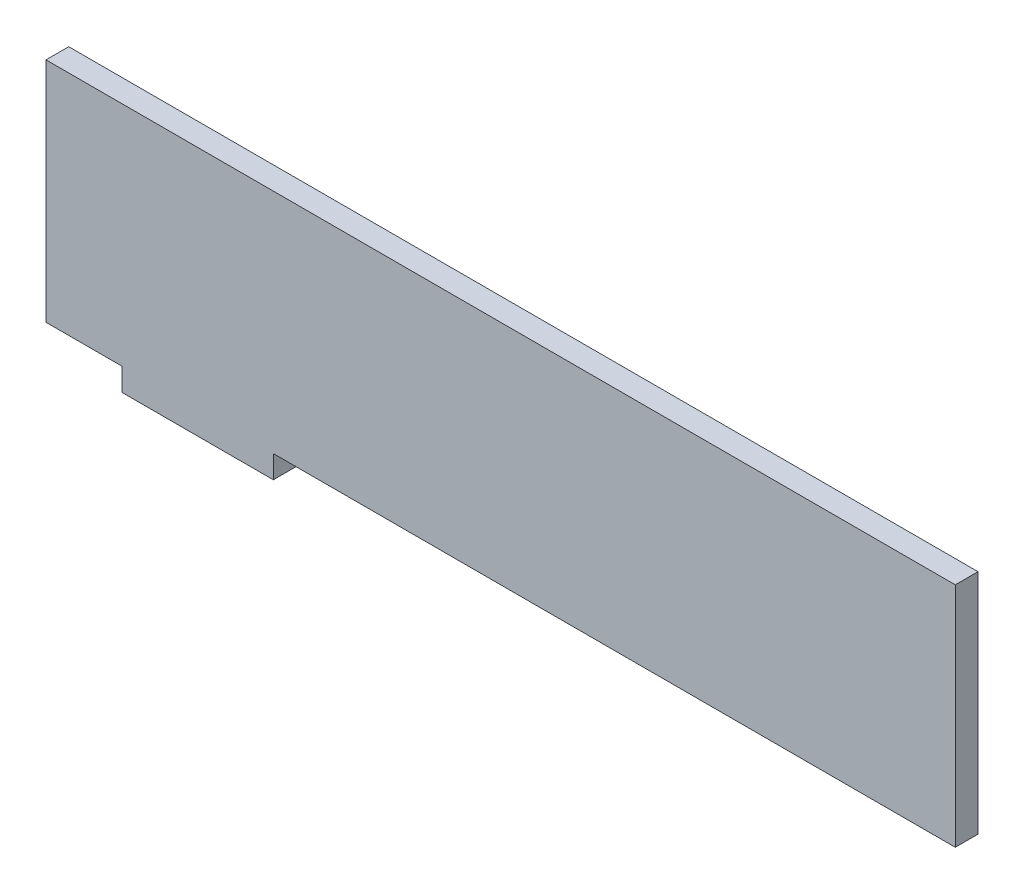
ISO-10303-21;
HEADER;
FILE_DESCRIPTION(('STEP AP214'),'2;1');
FILE_NAME('part.step','',(''),(''),'','','');
FILE_SCHEMA(('AUTOMOTIVE_DESIGN { 1 0 10303 214 1 1 1 1 }'));
ENDSEC;
DATA;
#1=APPLICATION_CONTEXT('core data for automotive mechanical design processes');
#2=APPLICATION_PROTOCOL_DEFINITION('international standard','automotive_design',2000,#1);
#3=PRODUCT_CONTEXT('',#1,'mechanical');
#4=PRODUCT('Part','Part','',(#3));
#5=PRODUCT_RELATED_PRODUCT_CATEGORY('part','',(#4));
#6=PRODUCT_DEFINITION_FORMATION('','',#4);
#7=PRODUCT_DEFINITION_CONTEXT('part definition',#1,'design');
#8=PRODUCT_DEFINITION('design','',#6,#7);
#9=PRODUCT_DEFINITION_SHAPE('','',#8);
#10=(LENGTH_UNIT() NAMED_UNIT(*) SI_UNIT(.MILLI.,.METRE.));
#11=(NAMED_UNIT(*) PLANE_ANGLE_UNIT() SI_UNIT($,.RADIAN.));
#12=(NAMED_UNIT(*) SI_UNIT($,.STERADIAN.) SOLID_ANGLE_UNIT());
#13=UNCERTAINTY_MEASURE_WITH_UNIT(LENGTH_MEASURE(1.E-05),#10,'distance_accuracy_value','');
#14=(GEOMETRIC_REPRESENTATION_CONTEXT(3) GLOBAL_UNCERTAINTY_ASSIGNED_CONTEXT((#13)) GLOBAL_UNIT_ASSIGNED_CONTEXT((#10,
#11,#12)) REPRESENTATION_CONTEXT('',''));
#15=CARTESIAN_POINT('',(0.,0.,0.));
#16=DIRECTION('',(0.,0.,1.));
#17=DIRECTION('',(1.,0.,0.));
#18=AXIS2_PLACEMENT_3D('',#15,#16,#17);
#19=CARTESIAN_POINT('',(-25.,-16.,3.));
#20=DIRECTION('',(1.,0.,0.));
#21=DIRECTION('',(0.,1.,0.));
#22=AXIS2_PLACEMENT_3D('',#19,#20,#21);
#23=PLANE('',#22);
#24=DIRECTION('',(0.,-1.,0.));
#25=VECTOR('',#24,1.);
#26=CARTESIAN_POINT('',(-25.,-16.,0.));
#27=LINE('',#26,#25);
#28=CARTESIAN_POINT('',(-25.,-13.,0.));
#29=VERTEX_POINT('',#28);
#30=CARTESIAN_POINT('',(-25.,-16.,0.));
#31=VERTEX_POINT('',#30);
#32=EDGE_CURVE('E133',#29,#31,#27,.T.);
#33=ORIENTED_EDGE('',*,*,#32,.T.);
#34=DIRECTION('',(0.,0.,-1.));
#35=VECTOR('',#34,1.);
#36=CARTESIAN_POINT('',(-25.,-16.,3.));
#37=LINE('',#36,#35);
#38=CARTESIAN_POINT('',(-25.,-16.,3.));
#39=VERTEX_POINT('',#38);
#40=EDGE_CURVE('E11',#39,#31,#37,.T.);
#41=ORIENTED_EDGE('',*,*,#40,.F.);
#42=DIRECTION('',(0.,-1.,0.));
#43=VECTOR('',#42,1.);
#44=CARTESIAN_POINT('',(-25.,-16.,3.));
#45=LINE('',#44,#43);
#46=CARTESIAN_POINT('',(-25.,-13.,3.));
#47=VERTEX_POINT('',#46);
#48=EDGE_CURVE('E147',#47,#39,#45,.T.);
#49=ORIENTED_EDGE('',*,*,#48,.F.);
#50=DIRECTION('',(0.,0.,-1.));
#51=VECTOR('',#50,1.);
#52=CARTESIAN_POINT('',(-25.,-13.,3.));
#53=LINE('',#52,#51);
#54=EDGE_CURVE('E129',#47,#29,#53,.T.);
#55=ORIENTED_EDGE('',*,*,#54,.T.);
#56=EDGE_LOOP('',(#33,#41,#49,#55));
#57=FACE_BOUND('',#56,.T.);
#58=ADVANCED_FACE('F37',(#57),#23,.F.);
#59=CARTESIAN_POINT('',(-4.99999999999999,-16.,3.));
#60=DIRECTION('',(0.,1.,0.));
#61=DIRECTION('',(-1.,0.,0.));
#62=AXIS2_PLACEMENT_3D('',#59,#60,#61);
#63=PLANE('',#62);
#64=DIRECTION('',(1.,0.,0.));
#65=VECTOR('',#64,1.);
#66=CARTESIAN_POINT('',(-4.99999999999999,-16.,0.));
#67=LINE('',#66,#65);
#68=CARTESIAN_POINT('',(-4.99999999999999,-16.,0.));
#69=VERTEX_POINT('',#68);
#70=EDGE_CURVE('E136',#31,#69,#67,.T.);
#71=ORIENTED_EDGE('',*,*,#70,.T.);
#72=DIRECTION('',(0.,0.,-1.));
#73=VECTOR('',#72,1.);
#74=CARTESIAN_POINT('',(-4.99999999999999,-16.,3.));
#75=LINE('',#74,#73);
#76=CARTESIAN_POINT('',(-4.99999999999999,-16.,3.));
#77=VERTEX_POINT('',#76);
#78=EDGE_CURVE('E45',#77,#69,#75,.T.);
#79=ORIENTED_EDGE('',*,*,#78,.F.);
#80=DIRECTION('',(1.,0.,0.));
#81=VECTOR('',#80,1.);
#82=CARTESIAN_POINT('',(-4.99999999999999,-16.,3.));
#83=LINE('',#82,#81);
#84=EDGE_CURVE('E96',#39,#77,#83,.T.);
#85=ORIENTED_EDGE('',*,*,#84,.F.);
#86=ORIENTED_EDGE('',*,*,#40,.T.);
#87=EDGE_LOOP('',(#71,#79,#85,#86));
#88=FACE_BOUND('',#87,.T.);
#89=ADVANCED_FACE('F182',(#88),#63,.F.);
#90=CARTESIAN_POINT('',(-4.99999999999999,-13.,3.));
#91=DIRECTION('',(-1.,0.,0.));
#92=DIRECTION('',(0.,-1.,0.));
#93=AXIS2_PLACEMENT_3D('',#90,#91,#92);
#94=PLANE('',#93);
#95=DIRECTION('',(0.,1.,0.));
#96=VECTOR('',#95,1.);
#97=CARTESIAN_POINT('',(-4.99999999999999,-13.,0.));
#98=LINE('',#97,#96);
#99=CARTESIAN_POINT('',(-4.99999999999999,-13.,0.));
#100=VERTEX_POINT('',#99);
#101=EDGE_CURVE('E138',#69,#100,#98,.T.);
#102=ORIENTED_EDGE('',*,*,#101,.T.);
#103=DIRECTION('',(0.,0.,-1.));
#104=VECTOR('',#103,1.);
#105=CARTESIAN_POINT('',(-4.99999999999999,-13.,3.));
#106=LINE('',#105,#104);
#107=CARTESIAN_POINT('',(-4.99999999999999,-13.,3.));
#108=VERTEX_POINT('',#107);
#109=EDGE_CURVE('E154',#108,#100,#106,.T.);
#110=ORIENTED_EDGE('',*,*,#109,.F.);
#111=DIRECTION('',(0.,1.,0.));
#112=VECTOR('',#111,1.);
#113=CARTESIAN_POINT('',(-4.99999999999999,-13.,3.));
#114=LINE('',#113,#112);
#115=EDGE_CURVE('E162',#77,#108,#114,.T.);
#116=ORIENTED_EDGE('',*,*,#115,.F.);
#117=ORIENTED_EDGE('',*,*,#78,.T.);
#118=EDGE_LOOP('',(#102,#110,#116,#117));
#119=FACE_BOUND('',#118,.T.);
#120=ADVANCED_FACE('F160',(#119),#94,.F.);
#121=CARTESIAN_POINT('',(85.,-13.,3.));
#122=DIRECTION('',(0.,1.,0.));
#123=DIRECTION('',(-1.,0.,0.));
#124=AXIS2_PLACEMENT_3D('',#121,#122,#123);
#125=PLANE('',#124);
#126=DIRECTION('',(1.,0.,0.));
#127=VECTOR('',#126,1.);
#128=CARTESIAN_POINT('',(85.,-13.,0.));
#129=LINE('',#128,#127);
#130=CARTESIAN_POINT('',(85.,-13.,0.));
#131=VERTEX_POINT('',#130);
#132=EDGE_CURVE('E140',#100,#131,#129,.T.);
#133=ORIENTED_EDGE('',*,*,#132,.T.);
#134=DIRECTION('',(0.,0.,-1.));
#135=VECTOR('',#134,1.);
#136=CARTESIAN_POINT('',(85.,-13.,3.));
#137=LINE('',#136,#135);
#138=CARTESIAN_POINT('',(85.,-13.,3.));
#139=VERTEX_POINT('',#138);
#140=EDGE_CURVE('E151',#139,#131,#137,.T.);
#141=ORIENTED_EDGE('',*,*,#140,.F.);
#142=DIRECTION('',(1.,0.,0.));
#143=VECTOR('',#142,1.);
#144=CARTESIAN_POINT('',(85.,-13.,3.));
#145=LINE('',#144,#143);
#146=EDGE_CURVE('E174',#108,#139,#145,.T.);
#147=ORIENTED_EDGE('',*,*,#146,.F.);
#148=ORIENTED_EDGE('',*,*,#109,.T.);
#149=EDGE_LOOP('',(#133,#141,#147,#148));
#150=FACE_BOUND('',#149,.T.);
#151=ADVANCED_FACE('F170',(#150),#125,.F.);
#152=CARTESIAN_POINT('',(85.,17.,3.));
#153=DIRECTION('',(-1.,0.,0.));
#154=DIRECTION('',(0.,-1.,0.));
#155=AXIS2_PLACEMENT_3D('',#152,#153,#154);
#156=PLANE('',#155);
#157=DIRECTION('',(0.,1.,0.));
#158=VECTOR('',#157,1.);
#159=CARTESIAN_POINT('',(85.,17.,0.));
#160=LINE('',#159,#158);
#161=CARTESIAN_POINT('',(85.,17.,0.));
#162=VERTEX_POINT('',#161);
#163=EDGE_CURVE('E142',#131,#162,#160,.T.);
#164=ORIENTED_EDGE('',*,*,#163,.T.);
#165=DIRECTION('',(0.,0.,-1.));
#166=VECTOR('',#165,1.);
#167=CARTESIAN_POINT('',(85.,17.,3.));
#168=LINE('',#167,#166);
#169=CARTESIAN_POINT('',(85.,17.,3.));
#170=VERTEX_POINT('',#169);
#171=EDGE_CURVE('E124',#170,#162,#168,.T.);
#172=ORIENTED_EDGE('',*,*,#171,.F.);
#173=DIRECTION('',(0.,1.,0.));
#174=VECTOR('',#173,1.);
#175=CARTESIAN_POINT('',(85.,17.,3.));
#176=LINE('',#175,#174);
#177=EDGE_CURVE('E115',#139,#170,#176,.T.);
#178=ORIENTED_EDGE('',*,*,#177,.F.);
#179=ORIENTED_EDGE('',*,*,#140,.T.);
#180=EDGE_LOOP('',(#164,#172,#178,#179));
#181=FACE_BOUND('',#180,.T.);
#182=ADVANCED_FACE('F173',(#181),#156,.F.);
#183=CARTESIAN_POINT('',(-35.,17.,3.));
#184=DIRECTION('',(0.,-1.,0.));
#185=DIRECTION('',(0.,0.,-1.));
#186=AXIS2_PLACEMENT_3D('',#183,#184,#185);
#187=PLANE('',#186);
#188=DIRECTION('',(-1.,0.,0.));
#189=VECTOR('',#188,1.);
#190=CARTESIAN_POINT('',(-35.,17.,0.));
#191=LINE('',#190,#189);
#192=CARTESIAN_POINT('',(-35.,17.,0.));
#193=VERTEX_POINT('',#192);
#194=EDGE_CURVE('E123',#162,#193,#191,.T.);
#195=ORIENTED_EDGE('',*,*,#194,.T.);
#196=DIRECTION('',(0.,0.,-1.));
#197=VECTOR('',#196,1.);
#198=CARTESIAN_POINT('',(-35.,17.,3.));
#199=LINE('',#198,#197);
#200=CARTESIAN_POINT('',(-35.,17.,3.));
#201=VERTEX_POINT('',#200);
#202=EDGE_CURVE('E120',#201,#193,#199,.T.);
#203=ORIENTED_EDGE('',*,*,#202,.F.);
#204=DIRECTION('',(-1.,0.,0.));
#205=VECTOR('',#204,1.);
#206=CARTESIAN_POINT('',(-35.,17.,3.));
#207=LINE('',#206,#205);
#208=EDGE_CURVE('E109',#170,#201,#207,.T.);
#209=ORIENTED_EDGE('',*,*,#208,.F.);
#210=ORIENTED_EDGE('',*,*,#171,.T.);
#211=EDGE_LOOP('',(#195,#203,#209,#210));
#212=FACE_BOUND('',#211,.T.);
#213=ADVANCED_FACE('F121',(#212),#187,.F.);
#214=CARTESIAN_POINT('',(-35.,-13.,3.));
#215=DIRECTION('',(1.,0.,0.));
#216=DIRECTION('',(0.,0.,-1.));
#217=AXIS2_PLACEMENT_3D('',#214,#215,#216);
#218=PLANE('',#217);
#219=DIRECTION('',(0.,-1.,0.));
#220=VECTOR('',#219,1.);
#221=CARTESIAN_POINT('',(-35.,-13.,0.));
#222=LINE('',#221,#220);
#223=CARTESIAN_POINT('',(-35.,-13.,0.));
#224=VERTEX_POINT('',#223);
#225=EDGE_CURVE('E82',#193,#224,#222,.T.);
#226=ORIENTED_EDGE('',*,*,#225,.T.);
#227=DIRECTION('',(0.,0.,-1.));
#228=VECTOR('',#227,1.);
#229=CARTESIAN_POINT('',(-35.,-13.,3.));
#230=LINE('',#229,#228);
#231=CARTESIAN_POINT('',(-35.,-13.,3.));
#232=VERTEX_POINT('',#231);
#233=EDGE_CURVE('E125',#232,#224,#230,.T.);
#234=ORIENTED_EDGE('',*,*,#233,.F.);
#235=DIRECTION('',(0.,-1.,0.));
#236=VECTOR('',#235,1.);
#237=CARTESIAN_POINT('',(-35.,-13.,3.));
#238=LINE('',#237,#236);
#239=EDGE_CURVE('E113',#201,#232,#238,.T.);
#240=ORIENTED_EDGE('',*,*,#239,.F.);
#241=ORIENTED_EDGE('',*,*,#202,.T.);
#242=EDGE_LOOP('',(#226,#234,#240,#241));
#243=FACE_BOUND('',#242,.T.);
#244=ADVANCED_FACE('F127',(#243),#218,.F.);
#245=CARTESIAN_POINT('',(-25.,-13.,3.));
#246=DIRECTION('',(0.,1.,0.));
#247=DIRECTION('',(-1.,0.,0.));
#248=AXIS2_PLACEMENT_3D('',#245,#246,#247);
#249=PLANE('',#248);
#250=DIRECTION('',(1.,0.,0.));
#251=VECTOR('',#250,1.);
#252=CARTESIAN_POINT('',(-25.,-13.,0.));
#253=LINE('',#252,#251);
#254=EDGE_CURVE('E88',#224,#29,#253,.T.);
#255=ORIENTED_EDGE('',*,*,#254,.T.);
#256=ORIENTED_EDGE('',*,*,#54,.F.);
#257=DIRECTION('',(1.,0.,0.));
#258=VECTOR('',#257,1.);
#259=CARTESIAN_POINT('',(-25.,-13.,3.));
#260=LINE('',#259,#258);
#261=EDGE_CURVE('E53',#232,#47,#260,.T.);
#262=ORIENTED_EDGE('',*,*,#261,.F.);
#263=ORIENTED_EDGE('',*,*,#233,.T.);
#264=EDGE_LOOP('',(#255,#256,#262,#263));
#265=FACE_BOUND('',#264,.T.);
#266=ADVANCED_FACE('F198',(#265),#249,.F.);
#267=CARTESIAN_POINT('',(0.,0.,3.));
#268=DIRECTION('',(0.,0.,1.));
#269=DIRECTION('',(1.,0.,0.));
#270=AXIS2_PLACEMENT_3D('',#267,#268,#269);
#271=PLANE('',#270);
#272=ORIENTED_EDGE('',*,*,#48,.T.);
#273=ORIENTED_EDGE('',*,*,#84,.T.);
#274=ORIENTED_EDGE('',*,*,#115,.T.);
#275=ORIENTED_EDGE('',*,*,#146,.T.);
#276=ORIENTED_EDGE('',*,*,#177,.T.);
#277=ORIENTED_EDGE('',*,*,#208,.T.);
#278=ORIENTED_EDGE('',*,*,#239,.T.);
#279=ORIENTED_EDGE('',*,*,#261,.T.);
#280=EDGE_LOOP('',(#272,#273,#274,#275,#276,#277,#278,#279));
#281=FACE_BOUND('',#280,.T.);
#282=ADVANCED_FACE('F111',(#281),#271,.T.);
#283=CARTESIAN_POINT('',(0.,0.,0.));
#284=DIRECTION('',(0.,0.,1.));
#285=DIRECTION('',(1.,0.,0.));
#286=AXIS2_PLACEMENT_3D('',#283,#284,#285);
#287=PLANE('',#286);
#288=ORIENTED_EDGE('',*,*,#32,.F.);
#289=ORIENTED_EDGE('',*,*,#254,.F.);
#290=ORIENTED_EDGE('',*,*,#225,.F.);
#291=ORIENTED_EDGE('',*,*,#194,.F.);
#292=ORIENTED_EDGE('',*,*,#163,.F.);
#293=ORIENTED_EDGE('',*,*,#132,.F.);
#294=ORIENTED_EDGE('',*,*,#101,.F.);
#295=ORIENTED_EDGE('',*,*,#70,.F.);
#296=EDGE_LOOP('',(#288,#289,#290,#291,#292,#293,#294,#295));
#297=FACE_BOUND('',#296,.T.);
#298=ADVANCED_FACE('F166',(#297),#287,.F.);
#299=CLOSED_SHELL('',(#58,#89,#120,#151,#182,#213,#244,#266,#282,#298));
#300=MANIFOLD_SOLID_BREP('B2',#299);
#301=ADVANCED_BREP_SHAPE_REPRESENTATION('',(#18,#300),#14);
#302=SHAPE_DEFINITION_REPRESENTATION(#9,#301);
ENDSEC;
END-ISO-10303-21;
